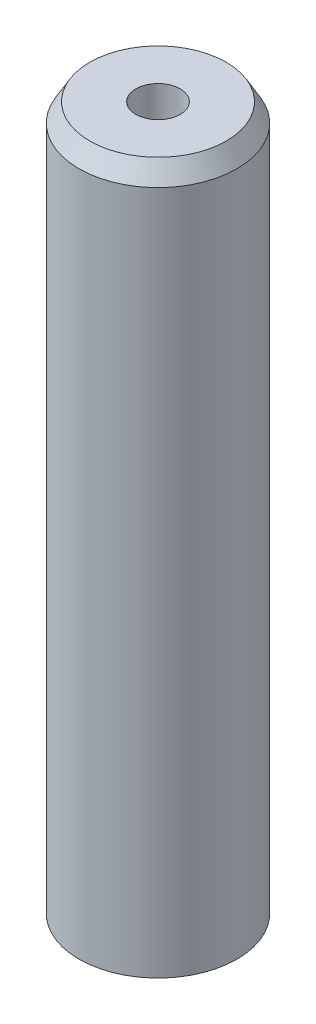
ISO-10303-21;
HEADER;
FILE_DESCRIPTION(('STEP AP214'),'2;1');
FILE_NAME('part.step','',(''),(''),'','','');
FILE_SCHEMA(('AUTOMOTIVE_DESIGN { 1 0 10303 214 1 1 1 1 }'));
ENDSEC;
DATA;
#1=APPLICATION_CONTEXT('core data for automotive mechanical design processes');
#2=APPLICATION_PROTOCOL_DEFINITION('international standard','automotive_design',2000,#1);
#3=PRODUCT_CONTEXT('',#1,'mechanical');
#4=PRODUCT('Part','Part','',(#3));
#5=PRODUCT_RELATED_PRODUCT_CATEGORY('part','',(#4));
#6=PRODUCT_DEFINITION_FORMATION('','',#4);
#7=PRODUCT_DEFINITION_CONTEXT('part definition',#1,'design');
#8=PRODUCT_DEFINITION('design','',#6,#7);
#9=PRODUCT_DEFINITION_SHAPE('','',#8);
#10=(LENGTH_UNIT() NAMED_UNIT(*) SI_UNIT(.MILLI.,.METRE.));
#11=(NAMED_UNIT(*) PLANE_ANGLE_UNIT() SI_UNIT($,.RADIAN.));
#12=(NAMED_UNIT(*) SI_UNIT($,.STERADIAN.) SOLID_ANGLE_UNIT());
#13=UNCERTAINTY_MEASURE_WITH_UNIT(LENGTH_MEASURE(1.E-05),#10,'distance_accuracy_value','');
#14=(GEOMETRIC_REPRESENTATION_CONTEXT(3) GLOBAL_UNCERTAINTY_ASSIGNED_CONTEXT((#13)) GLOBAL_UNIT_ASSIGNED_CONTEXT((#10,
#11,#12)) REPRESENTATION_CONTEXT('',''));
#15=CARTESIAN_POINT('',(0.,0.,0.));
#16=DIRECTION('',(0.,0.,1.));
#17=DIRECTION('',(1.,0.,0.));
#18=AXIS2_PLACEMENT_3D('',#15,#16,#17);
#19=CARTESIAN_POINT('',(0.,90.3687315006862,0.));
#20=DIRECTION('',(0.,-1.,0.));
#21=DIRECTION('',(0.,0.,-1.));
#22=AXIS2_PLACEMENT_3D('',#19,#20,#21);
#23=CYLINDRICAL_SURFACE('',#22,10.);
#24=CARTESIAN_POINT('',(0.,88.0084526670346,0.));
#25=DIRECTION('',(0.,1.,0.));
#26=DIRECTION('',(0.,0.,1.));
#27=AXIS2_PLACEMENT_3D('',#24,#25,#26);
#28=CIRCLE('',#27,10.);
#29=CARTESIAN_POINT('',(0.,88.0084526670346,-10.));
#30=VERTEX_POINT('',#29);
#31=EDGE_CURVE('E50',#30,#30,#28,.F.);
#32=CARTESIAN_POINT('',(0.,1.3627076199714,0.));
#33=DIRECTION('',(0.,1.,0.));
#34=DIRECTION('',(0.,0.,1.));
#35=AXIS2_PLACEMENT_3D('',#32,#33,#34);
#36=CIRCLE('',#35,10.);
#37=CARTESIAN_POINT('',(0.,1.3627076199714,-10.));
#38=VERTEX_POINT('',#37);
#39=EDGE_CURVE('E51',#38,#38,#36,.T.);
#40=CARTESIAN_POINT('',(0.,88.0084526670346,-10.));
#41=CARTESIAN_POINT('',(0.,87.1058928227944,-10.));
#42=CARTESIAN_POINT('',(0.,86.2033329785541,-10.));
#43=CARTESIAN_POINT('',(0.,84.3982132900737,-10.));
#44=CARTESIAN_POINT('',(0.,83.4956534458334,-10.));
#45=CARTESIAN_POINT('',(0.,81.6905337573529,-10.));
#46=CARTESIAN_POINT('',(0.,80.7879739131127,-10.));
#47=CARTESIAN_POINT('',(0.,78.9828542246322,-10.));
#48=CARTESIAN_POINT('',(0.,78.080294380392,-10.));
#49=CARTESIAN_POINT('',(0.,76.2751746919115,-10.));
#50=CARTESIAN_POINT('',(0.,75.3726148476712,-10.));
#51=CARTESIAN_POINT('',(0.,73.5674951591908,-10.));
#52=CARTESIAN_POINT('',(0.,72.6649353149505,-10.));
#53=CARTESIAN_POINT('',(0.,70.85981562647,-10.));
#54=CARTESIAN_POINT('',(0.,69.9572557822298,-10.));
#55=CARTESIAN_POINT('',(0.,68.1521360937493,-10.));
#56=CARTESIAN_POINT('',(0.,67.2495762495091,-10.));
#57=CARTESIAN_POINT('',(0.,65.4444565610286,-10.));
#58=CARTESIAN_POINT('',(0.,64.5418967167883,-10.));
#59=CARTESIAN_POINT('',(0.,62.7367770283078,-10.));
#60=CARTESIAN_POINT('',(0.,61.8342171840676,-10.));
#61=CARTESIAN_POINT('',(0.,60.0290974955871,-10.));
#62=CARTESIAN_POINT('',(0.,59.1265376513469,-10.));
#63=CARTESIAN_POINT('',(0.,57.3214179628664,-10.));
#64=CARTESIAN_POINT('',(0.,56.4188581186262,-10.));
#65=CARTESIAN_POINT('',(0.,54.6137384301457,-10.));
#66=CARTESIAN_POINT('',(0.,53.7111785859054,-10.));
#67=CARTESIAN_POINT('',(0.,51.9060588974249,-10.));
#68=CARTESIAN_POINT('',(0.,51.0034990531847,-10.));
#69=CARTESIAN_POINT('',(0.,49.1983793647042,-10.));
#70=CARTESIAN_POINT('',(0.,48.295819520464,-10.));
#71=CARTESIAN_POINT('',(0.,46.4906998319835,-10.));
#72=CARTESIAN_POINT('',(0.,45.5881399877433,-10.));
#73=CARTESIAN_POINT('',(0.,43.7830202992628,-10.));
#74=CARTESIAN_POINT('',(0.,42.8804604550225,-10.));
#75=CARTESIAN_POINT('',(0.,41.075340766542,-10.));
#76=CARTESIAN_POINT('',(0.,40.1727809223018,-10.));
#77=CARTESIAN_POINT('',(0.,38.3676612338213,-10.));
#78=CARTESIAN_POINT('',(0.,37.4651013895811,-10.));
#79=CARTESIAN_POINT('',(0.,35.6599817011006,-10.));
#80=CARTESIAN_POINT('',(0.,34.7574218568604,-10.));
#81=CARTESIAN_POINT('',(0.,32.9523021683799,-10.));
#82=CARTESIAN_POINT('',(0.,32.0497423241396,-10.));
#83=CARTESIAN_POINT('',(0.,30.2446226356591,-10.));
#84=CARTESIAN_POINT('',(0.,29.3420627914189,-10.));
#85=CARTESIAN_POINT('',(0.,27.5369431029384,-10.));
#86=CARTESIAN_POINT('',(0.,26.6343832586982,-10.));
#87=CARTESIAN_POINT('',(0.,24.8292635702177,-10.));
#88=CARTESIAN_POINT('',(0.,23.9267037259775,-10.));
#89=CARTESIAN_POINT('',(0.,22.121584037497,-10.));
#90=CARTESIAN_POINT('',(0.,21.2190241932567,-10.));
#91=CARTESIAN_POINT('',(0.,19.4139045047762,-10.));
#92=CARTESIAN_POINT('',(0.,18.511344660536,-10.));
#93=CARTESIAN_POINT('',(0.,16.7062249720555,-10.));
#94=CARTESIAN_POINT('',(0.,15.8036651278153,-10.));
#95=CARTESIAN_POINT('',(0.,13.9985454393348,-10.));
#96=CARTESIAN_POINT('',(0.,13.0959855950945,-10.));
#97=CARTESIAN_POINT('',(0.,11.2908659066141,-10.));
#98=CARTESIAN_POINT('',(0.,10.3883060623738,-10.));
#99=CARTESIAN_POINT('',(0.,8.58318637389334,-10.));
#100=CARTESIAN_POINT('',(0.,7.68062652965309,-10.));
#101=CARTESIAN_POINT('',(0.,5.87550684117261,-10.));
#102=CARTESIAN_POINT('',(0.,4.97294699693236,-10.));
#103=CARTESIAN_POINT('',(0.,3.16782730845188,-10.));
#104=CARTESIAN_POINT('',(0.,2.26526746421164,-10.));
#105=CARTESIAN_POINT('',(0.,1.3627076199714,-10.));
#106=B_SPLINE_CURVE_WITH_KNOTS('',3,(#40,#41,#42,#43,#44,#45,#46,#47,#48,#49,#50,#51,#52,#53,
#54,#55,#56,#57,#58,#59,#60,#61,#62,#63,#64,#65,#66,#67,#68,#69,#70,#71,#72,#73,#74,#75,#76,#77,
#78,#79,#80,#81,#82,#83,#84,#85,#86,#87,#88,#89,#90,#91,#92,#93,#94,#95,#96,#97,#98,#99,#100,
#101,#102,#103,#104,#105),.UNSPECIFIED.,.F.,.F.,(4,2,2,2,2,2,2,2,2,2,2,2,2,2,2,2,2,2,2,2,2,2,2,
2,2,2,2,2,2,2,2,2,4),(0.,2.70767953272072,5.41535906544145,8.12303859816217,10.8307181308829,
13.5383976636036,16.2460771963243,18.9537567290451,21.6614362617658,24.3691157944865,
27.0767953272072,29.784474859928,32.4921543926487,35.1998339253694,37.9075134580902,
40.6151929908109,43.3228725235316,46.0305520562523,48.7382315889731,51.4459111216938,
54.1535906544145,56.8612701871352,59.568949719856,62.2766292525767,64.9843087852974,
67.6919883180181,70.3996678507389,73.1073473834596,75.8150269161803,78.522706448901,
81.2303859816218,83.9380655143425,86.6457450470632),.UNSPECIFIED.);
#107=EDGE_CURVE('BSEAM39',#30,#38,#106,.T.);
#108=ORIENTED_EDGE('',*,*,#31,.T.);
#109=ORIENTED_EDGE('',*,*,#39,.T.);
#110=ORIENTED_EDGE('',*,*,#107,.T.);
#111=ORIENTED_EDGE('',*,*,#107,.F.);
#112=EDGE_LOOP('',(#108,#110,#109,#111));
#113=FACE_BOUND('',#112,.T.);
#114=ADVANCED_FACE('F39',(#113),#23,.T.);
#115=CARTESIAN_POINT('',(0.,90.3687315006862,0.));
#116=DIRECTION('',(0.,1.,0.));
#117=DIRECTION('',(0.,0.,1.));
#118=AXIS2_PLACEMENT_3D('',#115,#116,#117);
#119=PLANE('',#118);
#120=CARTESIAN_POINT('',(0.,90.3687315006862,0.));
#121=DIRECTION('',(0.,1.,0.));
#122=DIRECTION('',(0.,0.,1.));
#123=AXIS2_PLACEMENT_3D('',#120,#121,#122);
#124=CIRCLE('',#123,8.63729238002868);
#125=CARTESIAN_POINT('',(0.,90.3687315006862,8.63729238002868));
#126=VERTEX_POINT('',#125);
#127=EDGE_CURVE('E54',#126,#126,#124,.T.);
#128=ORIENTED_EDGE('',*,*,#127,.T.);
#129=EDGE_LOOP('',(#128));
#130=FACE_BOUND('',#129,.T.);
#131=CARTESIAN_POINT('',(0.,90.3687315006862,0.));
#132=DIRECTION('',(0.,1.,0.));
#133=DIRECTION('',(0.,0.,1.));
#134=AXIS2_PLACEMENT_3D('',#131,#132,#133);
#135=CIRCLE('',#134,2.80693542975081);
#136=CARTESIAN_POINT('',(0.,90.3687315006862,-2.80693542975081));
#137=VERTEX_POINT('',#136);
#138=EDGE_CURVE('E58',#137,#137,#135,.T.);
#139=ORIENTED_EDGE('',*,*,#138,.F.);
#140=EDGE_LOOP('',(#139));
#141=FACE_BOUND('',#140,.T.);
#142=ADVANCED_FACE('F69',(#130,#141),#119,.T.);
#143=CARTESIAN_POINT('',(0.,0.,0.));
#144=DIRECTION('',(0.,1.,0.));
#145=DIRECTION('',(0.,0.,1.));
#146=AXIS2_PLACEMENT_3D('',#143,#144,#145);
#147=PLANE('',#146);
#148=CARTESIAN_POINT('',(0.,0.,0.));
#149=DIRECTION('',(0.,1.,0.));
#150=DIRECTION('',(0.,0.,1.));
#151=AXIS2_PLACEMENT_3D('',#148,#149,#150);
#152=CIRCLE('',#151,7.63972116634828);
#153=CARTESIAN_POINT('',(0.,0.,7.63972116634828));
#154=VERTEX_POINT('',#153);
#155=EDGE_CURVE('E10',#154,#154,#152,.F.);
#156=ORIENTED_EDGE('',*,*,#155,.T.);
#157=EDGE_LOOP('',(#156));
#158=FACE_BOUND('',#157,.T.);
#159=CARTESIAN_POINT('',(0.,0.,0.));
#160=DIRECTION('',(0.,1.,0.));
#161=DIRECTION('',(0.,0.,1.));
#162=AXIS2_PLACEMENT_3D('',#159,#160,#161);
#163=CIRCLE('',#162,2.80693542975081);
#164=CARTESIAN_POINT('',(0.,0.,-2.80693542975081));
#165=VERTEX_POINT('',#164);
#166=EDGE_CURVE('E63',#165,#165,#163,.T.);
#167=ORIENTED_EDGE('',*,*,#166,.T.);
#168=EDGE_LOOP('',(#167));
#169=FACE_BOUND('',#168,.T.);
#170=ADVANCED_FACE('F75',(#158,#169),#147,.F.);
#171=CARTESIAN_POINT('',(0.,90.3687315006862,0.));
#172=DIRECTION('',(0.,-1.,0.));
#173=DIRECTION('',(0.,0.,-1.));
#174=AXIS2_PLACEMENT_3D('',#171,#172,#173);
#175=CYLINDRICAL_SURFACE('',#174,2.80693542975081);
#176=CARTESIAN_POINT('',(0.,90.3687315006862,-2.80693542975081));
#177=CARTESIAN_POINT('',(0.,89.4273905475541,-2.80693542975081));
#178=CARTESIAN_POINT('',(0.,88.4860495944219,-2.80693542975081));
#179=CARTESIAN_POINT('',(0.,86.6033676881576,-2.80693542975081));
#180=CARTESIAN_POINT('',(0.,85.6620267350255,-2.80693542975081));
#181=CARTESIAN_POINT('',(0.,83.7793448287612,-2.80693542975081));
#182=CARTESIAN_POINT('',(0.,82.838003875629,-2.80693542975081));
#183=CARTESIAN_POINT('',(0.,80.9553219693647,-2.80693542975081));
#184=CARTESIAN_POINT('',(0.,80.0139810162326,-2.80693542975081));
#185=CARTESIAN_POINT('',(0.,78.1312991099683,-2.80693542975081));
#186=CARTESIAN_POINT('',(0.,77.1899581568362,-2.80693542975081));
#187=CARTESIAN_POINT('',(0.,75.3072762505719,-2.80693542975081));
#188=CARTESIAN_POINT('',(0.,74.3659352974397,-2.80693542975081));
#189=CARTESIAN_POINT('',(0.,72.4832533911754,-2.80693542975081));
#190=CARTESIAN_POINT('',(0.,71.5419124380433,-2.80693542975081));
#191=CARTESIAN_POINT('',(0.,69.659230531779,-2.80693542975081));
#192=CARTESIAN_POINT('',(0.,68.7178895786468,-2.80693542975081));
#193=CARTESIAN_POINT('',(0.,66.8352076723825,-2.80693542975081));
#194=CARTESIAN_POINT('',(0.,65.8938667192504,-2.80693542975081));
#195=CARTESIAN_POINT('',(0.,64.0111848129861,-2.80693542975081));
#196=CARTESIAN_POINT('',(0.,63.0698438598539,-2.80693542975081));
#197=CARTESIAN_POINT('',(0.,61.1871619535896,-2.80693542975081));
#198=CARTESIAN_POINT('',(0.,60.2458210004575,-2.80693542975081));
#199=CARTESIAN_POINT('',(0.,58.3631390941932,-2.80693542975081));
#200=CARTESIAN_POINT('',(0.,57.421798141061,-2.80693542975081));
#201=CARTESIAN_POINT('',(0.,55.5391162347968,-2.80693542975081));
#202=CARTESIAN_POINT('',(0.,54.5977752816646,-2.80693542975081));
#203=CARTESIAN_POINT('',(0.,52.7150933754003,-2.80693542975081));
#204=CARTESIAN_POINT('',(0.,51.7737524222682,-2.80693542975081));
#205=CARTESIAN_POINT('',(0.,49.8910705160039,-2.80693542975081));
#206=CARTESIAN_POINT('',(0.,48.9497295628717,-2.80693542975081));
#207=CARTESIAN_POINT('',(0.,47.0670476566074,-2.80693542975081));
#208=CARTESIAN_POINT('',(0.,46.1257067034753,-2.80693542975081));
#209=CARTESIAN_POINT('',(0.,44.243024797211,-2.80693542975081));
#210=CARTESIAN_POINT('',(0.,43.3016838440788,-2.80693542975081));
#211=CARTESIAN_POINT('',(0.,41.4190019378145,-2.80693542975081));
#212=CARTESIAN_POINT('',(0.,40.4776609846824,-2.80693542975081));
#213=CARTESIAN_POINT('',(0.,38.5949790784181,-2.80693542975081));
#214=CARTESIAN_POINT('',(0.,37.6536381252859,-2.80693542975081));
#215=CARTESIAN_POINT('',(0.,35.7709562190216,-2.80693542975081));
#216=CARTESIAN_POINT('',(0.,34.8296152658895,-2.80693542975081));
#217=CARTESIAN_POINT('',(0.,32.9469333596252,-2.80693542975081));
#218=CARTESIAN_POINT('',(0.,32.005592406493,-2.80693542975081));
#219=CARTESIAN_POINT('',(0.,30.1229105002287,-2.80693542975081));
#220=CARTESIAN_POINT('',(0.,29.1815695470966,-2.80693542975081));
#221=CARTESIAN_POINT('',(0.,27.2988876408323,-2.80693542975081));
#222=CARTESIAN_POINT('',(0.,26.3575466877002,-2.80693542975081));
#223=CARTESIAN_POINT('',(0.,24.4748647814359,-2.80693542975081));
#224=CARTESIAN_POINT('',(0.,23.5335238283037,-2.80693542975081));
#225=CARTESIAN_POINT('',(0.,21.6508419220394,-2.80693542975081));
#226=CARTESIAN_POINT('',(0.,20.7095009689073,-2.80693542975081));
#227=CARTESIAN_POINT('',(0.,18.826819062643,-2.80693542975081));
#228=CARTESIAN_POINT('',(0.,17.8854781095108,-2.80693542975081));
#229=CARTESIAN_POINT('',(0.,16.0027962032465,-2.80693542975081));
#230=CARTESIAN_POINT('',(0.,15.0614552501144,-2.80693542975081));
#231=CARTESIAN_POINT('',(0.,13.1787733438501,-2.80693542975081));
#232=CARTESIAN_POINT('',(0.,12.2374323907179,-2.80693542975081));
#233=CARTESIAN_POINT('',(0.,10.3547504844536,-2.80693542975081));
#234=CARTESIAN_POINT('',(0.,9.41340953132148,-2.80693542975081));
#235=CARTESIAN_POINT('',(0.,7.53072762505718,-2.80693542975081));
#236=CARTESIAN_POINT('',(0.,6.58938667192504,-2.80693542975081));
#237=CARTESIAN_POINT('',(0.,4.70670476566074,-2.80693542975081));
#238=CARTESIAN_POINT('',(0.,3.76536381252859,-2.80693542975081));
#239=CARTESIAN_POINT('',(0.,1.88268190626429,-2.80693542975081));
#240=CARTESIAN_POINT('',(0.,0.941340953132146,-2.80693542975081));
#241=CARTESIAN_POINT('',(0.,0.,-2.80693542975081));
#242=B_SPLINE_CURVE_WITH_KNOTS('',3,(#176,#177,#178,#179,#180,#181,#182,#183,#184,#185,#186,
#187,#188,#189,#190,#191,#192,#193,#194,#195,#196,#197,#198,#199,#200,#201,#202,#203,#204,#205,
#206,#207,#208,#209,#210,#211,#212,#213,#214,#215,#216,#217,#218,#219,#220,#221,#222,#223,#224,
#225,#226,#227,#228,#229,#230,#231,#232,#233,#234,#235,#236,#237,#238,#239,#240,#241),
.UNSPECIFIED.,.F.,.F.,(4,2,2,2,2,2,2,2,2,2,2,2,2,2,2,2,2,2,2,2,2,2,2,2,2,2,2,2,2,2,2,2,4),(0.,
2.82402285939644,5.64804571879288,8.47206857818933,11.2960914375858,14.1201142969822,
16.9441371563787,19.7681600157751,22.5921828751715,25.416205734568,28.2402285939644,
31.0642514533609,33.8882743127573,36.7122971721538,39.5363200315502,42.3603428909467,
45.1843657503431,48.0083886097395,50.832411469136,53.6564343285324,56.4804571879289,
59.3044800473253,62.1285029067218,64.9525257661182,67.7765486255147,70.6005714849111,
73.4245943443076,76.248617203704,79.0726400631004,81.8966629224969,84.7206857818933,
87.5447086412898,90.3687315006862),.UNSPECIFIED.);
#243=EDGE_CURVE('BSEAM70',#137,#165,#242,.T.);
#244=ORIENTED_EDGE('',*,*,#138,.T.);
#245=ORIENTED_EDGE('',*,*,#166,.F.);
#246=ORIENTED_EDGE('',*,*,#243,.T.);
#247=ORIENTED_EDGE('',*,*,#243,.F.);
#248=EDGE_LOOP('',(#244,#246,#245,#247));
#249=FACE_BOUND('',#248,.T.);
#250=ADVANCED_FACE('F70',(#249),#175,.F.);
#251=CARTESIAN_POINT('',(0.,90.3687315006862,0.));
#252=DIRECTION('',(0.,-1.,0.));
#253=DIRECTION('',(0.,0.,-1.));
#254=AXIS2_PLACEMENT_3D('',#251,#252,#253);
#255=CONICAL_SURFACE('',#254,8.63729238002868,0.523598775598295);
#256=ORIENTED_EDGE('',*,*,#31,.F.);
#257=EDGE_LOOP('',(#256));
#258=FACE_BOUND('',#257,.T.);
#259=ORIENTED_EDGE('',*,*,#127,.F.);
#260=EDGE_LOOP('',(#259));
#261=FACE_BOUND('',#260,.T.);
#262=ADVANCED_FACE('F81',(#258,#261),#255,.T.);
#263=CARTESIAN_POINT('',(0.,1.36270761997138,0.));
#264=DIRECTION('',(0.,1.,0.));
#265=DIRECTION('',(0.,0.,1.));
#266=AXIS2_PLACEMENT_3D('',#263,#264,#265);
#267=CONICAL_SURFACE('',#266,10.,1.0471975511966);
#268=ORIENTED_EDGE('',*,*,#155,.F.);
#269=EDGE_LOOP('',(#268));
#270=FACE_BOUND('',#269,.T.);
#271=ORIENTED_EDGE('',*,*,#39,.F.);
#272=EDGE_LOOP('',(#271));
#273=FACE_BOUND('',#272,.T.);
#274=ADVANCED_FACE('F45',(#270,#273),#267,.T.);
#275=CLOSED_SHELL('',(#114,#142,#170,#250,#262,#274));
#276=MANIFOLD_SOLID_BREP('B2',#275);
#277=ADVANCED_BREP_SHAPE_REPRESENTATION('',(#18,#276),#14);
#278=SHAPE_DEFINITION_REPRESENTATION(#9,#277);
ENDSEC;
END-ISO-10303-21;
